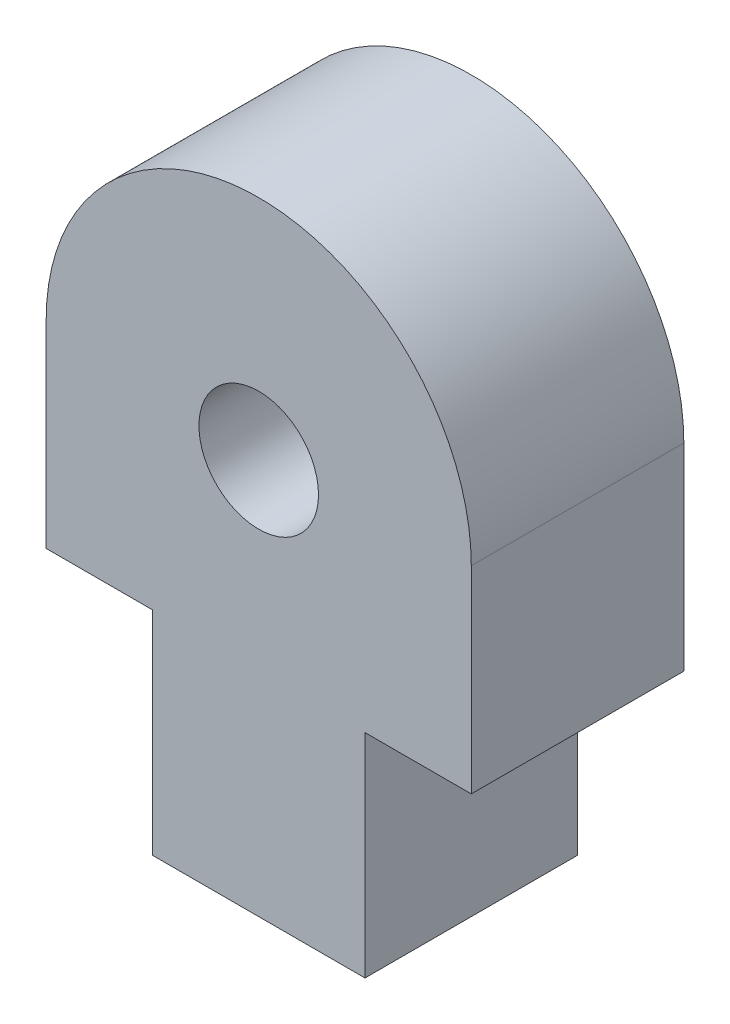
ISO-10303-21;
HEADER;
FILE_DESCRIPTION(('STEP AP214'),'2;1');
FILE_NAME('part.step','',(''),(''),'','','');
FILE_SCHEMA(('AUTOMOTIVE_DESIGN { 1 0 10303 214 1 1 1 1 }'));
ENDSEC;
DATA;
#1=APPLICATION_CONTEXT('core data for automotive mechanical design processes');
#2=APPLICATION_PROTOCOL_DEFINITION('international standard','automotive_design',2000,#1);
#3=PRODUCT_CONTEXT('',#1,'mechanical');
#4=PRODUCT('Part','Part','',(#3));
#5=PRODUCT_RELATED_PRODUCT_CATEGORY('part','',(#4));
#6=PRODUCT_DEFINITION_FORMATION('','',#4);
#7=PRODUCT_DEFINITION_CONTEXT('part definition',#1,'design');
#8=PRODUCT_DEFINITION('design','',#6,#7);
#9=PRODUCT_DEFINITION_SHAPE('','',#8);
#10=(LENGTH_UNIT() NAMED_UNIT(*) SI_UNIT(.MILLI.,.METRE.));
#11=(NAMED_UNIT(*) PLANE_ANGLE_UNIT() SI_UNIT($,.RADIAN.));
#12=(NAMED_UNIT(*) SI_UNIT($,.STERADIAN.) SOLID_ANGLE_UNIT());
#13=UNCERTAINTY_MEASURE_WITH_UNIT(LENGTH_MEASURE(1.E-05),#10,'distance_accuracy_value','');
#14=(GEOMETRIC_REPRESENTATION_CONTEXT(3) GLOBAL_UNCERTAINTY_ASSIGNED_CONTEXT((#13)) GLOBAL_UNIT_ASSIGNED_CONTEXT((#10,
#11,#12)) REPRESENTATION_CONTEXT('',''));
#15=CARTESIAN_POINT('',(0.,0.,0.));
#16=DIRECTION('',(0.,0.,1.));
#17=DIRECTION('',(1.,0.,0.));
#18=AXIS2_PLACEMENT_3D('',#15,#16,#17);
#19=CARTESIAN_POINT('',(0.,0.,6.35));
#20=DIRECTION('',(-1.,0.,0.));
#21=DIRECTION('',(0.,0.,1.));
#22=AXIS2_PLACEMENT_3D('',#19,#20,#21);
#23=PLANE('',#22);
#24=DIRECTION('',(0.,1.,0.));
#25=VECTOR('',#24,1.);
#26=CARTESIAN_POINT('',(0.,0.,0.));
#27=LINE('',#26,#25);
#28=CARTESIAN_POINT('',(0.,0.,0.));
#29=VERTEX_POINT('',#28);
#30=CARTESIAN_POINT('',(0.,6.35,0.));
#31=VERTEX_POINT('',#30);
#32=EDGE_CURVE('E128',#29,#31,#27,.T.);
#33=ORIENTED_EDGE('',*,*,#32,.T.);
#34=DIRECTION('',(0.,0.,-1.));
#35=VECTOR('',#34,1.);
#36=CARTESIAN_POINT('',(0.,6.35,6.35));
#37=LINE('',#36,#35);
#38=CARTESIAN_POINT('',(0.,6.35,6.35));
#39=VERTEX_POINT('',#38);
#40=EDGE_CURVE('E11',#39,#31,#37,.T.);
#41=ORIENTED_EDGE('',*,*,#40,.F.);
#42=DIRECTION('',(0.,1.,0.));
#43=VECTOR('',#42,1.);
#44=CARTESIAN_POINT('',(0.,0.,6.35));
#45=LINE('',#44,#43);
#46=CARTESIAN_POINT('',(0.,0.,6.35));
#47=VERTEX_POINT('',#46);
#48=EDGE_CURVE('E143',#47,#39,#45,.T.);
#49=ORIENTED_EDGE('',*,*,#48,.F.);
#50=DIRECTION('',(0.,0.,-1.));
#51=VECTOR('',#50,1.);
#52=CARTESIAN_POINT('',(0.,0.,6.35));
#53=LINE('',#52,#51);
#54=EDGE_CURVE('E124',#47,#29,#53,.T.);
#55=ORIENTED_EDGE('',*,*,#54,.T.);
#56=EDGE_LOOP('',(#33,#41,#49,#55));
#57=FACE_BOUND('',#56,.T.);
#58=ADVANCED_FACE('F32',(#57),#23,.F.);
#59=CARTESIAN_POINT('',(3.175,6.35,6.35));
#60=DIRECTION('',(0.,1.,0.));
#61=DIRECTION('',(-1.,0.,0.));
#62=AXIS2_PLACEMENT_3D('',#59,#60,#61);
#63=PLANE('',#62);
#64=DIRECTION('',(1.,0.,0.));
#65=VECTOR('',#64,1.);
#66=CARTESIAN_POINT('',(3.175,6.35,0.));
#67=LINE('',#66,#65);
#68=CARTESIAN_POINT('',(3.175,6.35,0.));
#69=VERTEX_POINT('',#68);
#70=EDGE_CURVE('E131',#31,#69,#67,.T.);
#71=ORIENTED_EDGE('',*,*,#70,.T.);
#72=DIRECTION('',(0.,0.,-1.));
#73=VECTOR('',#72,1.);
#74=CARTESIAN_POINT('',(3.175,6.35,6.35));
#75=LINE('',#74,#73);
#76=CARTESIAN_POINT('',(3.175,6.35,6.35));
#77=VERTEX_POINT('',#76);
#78=EDGE_CURVE('E40',#77,#69,#75,.T.);
#79=ORIENTED_EDGE('',*,*,#78,.F.);
#80=DIRECTION('',(1.,0.,0.));
#81=VECTOR('',#80,1.);
#82=CARTESIAN_POINT('',(3.175,6.35,6.35));
#83=LINE('',#82,#81);
#84=EDGE_CURVE('E91',#39,#77,#83,.T.);
#85=ORIENTED_EDGE('',*,*,#84,.F.);
#86=ORIENTED_EDGE('',*,*,#40,.T.);
#87=EDGE_LOOP('',(#71,#79,#85,#86));
#88=FACE_BOUND('',#87,.T.);
#89=ADVANCED_FACE('F196',(#88),#63,.F.);
#90=CARTESIAN_POINT('',(3.175,12.25423,6.35));
#91=DIRECTION('',(-1.,0.,0.));
#92=DIRECTION('',(0.,-1.,0.));
#93=AXIS2_PLACEMENT_3D('',#90,#91,#92);
#94=PLANE('',#93);
#95=DIRECTION('',(0.,1.,0.));
#96=VECTOR('',#95,1.);
#97=CARTESIAN_POINT('',(3.175,12.25423,0.));
#98=LINE('',#97,#96);
#99=CARTESIAN_POINT('',(3.175,12.25423,0.));
#100=VERTEX_POINT('',#99);
#101=EDGE_CURVE('E134',#69,#100,#98,.T.);
#102=ORIENTED_EDGE('',*,*,#101,.T.);
#103=DIRECTION('',(0.,0.,-1.));
#104=VECTOR('',#103,1.);
#105=CARTESIAN_POINT('',(3.175,12.25423,6.35));
#106=LINE('',#105,#104);
#107=CARTESIAN_POINT('',(3.175,12.25423,6.35));
#108=VERTEX_POINT('',#107);
#109=EDGE_CURVE('E150',#108,#100,#106,.T.);
#110=ORIENTED_EDGE('',*,*,#109,.F.);
#111=DIRECTION('',(0.,1.,0.));
#112=VECTOR('',#111,1.);
#113=CARTESIAN_POINT('',(3.175,12.25423,6.35));
#114=LINE('',#113,#112);
#115=EDGE_CURVE('E158',#77,#108,#114,.T.);
#116=ORIENTED_EDGE('',*,*,#115,.F.);
#117=ORIENTED_EDGE('',*,*,#78,.T.);
#118=EDGE_LOOP('',(#102,#110,#116,#117));
#119=FACE_BOUND('',#118,.T.);
#120=ADVANCED_FACE('F156',(#119),#94,.F.);
#121=CARTESIAN_POINT('',(-3.175,12.25423,6.35));
#122=DIRECTION('',(0.,0.,-1.));
#123=DIRECTION('',(-1.,0.,0.));
#124=AXIS2_PLACEMENT_3D('',#121,#122,#123);
#125=CYLINDRICAL_SURFACE('',#124,6.35);
#126=CARTESIAN_POINT('',(-3.175,12.25423,0.));
#127=DIRECTION('',(0.,0.,1.));
#128=DIRECTION('',(-1.,0.,0.));
#129=AXIS2_PLACEMENT_3D('',#126,#127,#128);
#130=CIRCLE('',#129,6.35);
#131=CARTESIAN_POINT('',(-9.525,12.25423,0.));
#132=VERTEX_POINT('',#131);
#133=EDGE_CURVE('E136',#100,#132,#130,.T.);
#134=ORIENTED_EDGE('',*,*,#133,.T.);
#135=DIRECTION('',(0.,0.,-1.));
#136=VECTOR('',#135,1.);
#137=CARTESIAN_POINT('',(-9.525,12.25423,6.35));
#138=LINE('',#137,#136);
#139=CARTESIAN_POINT('',(-9.525,12.25423,6.35));
#140=VERTEX_POINT('',#139);
#141=EDGE_CURVE('E147',#140,#132,#138,.T.);
#142=ORIENTED_EDGE('',*,*,#141,.F.);
#143=CARTESIAN_POINT('',(-3.175,12.25423,6.35));
#144=DIRECTION('',(0.,0.,1.));
#145=DIRECTION('',(-1.,0.,0.));
#146=AXIS2_PLACEMENT_3D('',#143,#144,#145);
#147=CIRCLE('',#146,6.35);
#148=EDGE_CURVE('E170',#108,#140,#147,.T.);
#149=ORIENTED_EDGE('',*,*,#148,.F.);
#150=ORIENTED_EDGE('',*,*,#109,.T.);
#151=EDGE_LOOP('',(#134,#142,#149,#150));
#152=FACE_BOUND('',#151,.T.);
#153=ADVANCED_FACE('F166',(#152),#125,.T.);
#154=CARTESIAN_POINT('',(-9.525,12.25423,6.35));
#155=DIRECTION('',(1.,0.,0.));
#156=DIRECTION('',(0.,1.,0.));
#157=AXIS2_PLACEMENT_3D('',#154,#155,#156);
#158=PLANE('',#157);
#159=DIRECTION('',(0.,-1.,0.));
#160=VECTOR('',#159,1.);
#161=CARTESIAN_POINT('',(-9.525,12.25423,0.));
#162=LINE('',#161,#160);
#163=CARTESIAN_POINT('',(-9.525,6.35,0.));
#164=VERTEX_POINT('',#163);
#165=EDGE_CURVE('E138',#132,#164,#162,.T.);
#166=ORIENTED_EDGE('',*,*,#165,.T.);
#167=DIRECTION('',(0.,0.,-1.));
#168=VECTOR('',#167,1.);
#169=CARTESIAN_POINT('',(-9.525,6.35,6.35));
#170=LINE('',#169,#168);
#171=CARTESIAN_POINT('',(-9.525,6.35,6.35));
#172=VERTEX_POINT('',#171);
#173=EDGE_CURVE('E119',#172,#164,#170,.T.);
#174=ORIENTED_EDGE('',*,*,#173,.F.);
#175=DIRECTION('',(0.,-1.,0.));
#176=VECTOR('',#175,1.);
#177=CARTESIAN_POINT('',(-9.525,12.25423,6.35));
#178=LINE('',#177,#176);
#179=EDGE_CURVE('E110',#140,#172,#178,.T.);
#180=ORIENTED_EDGE('',*,*,#179,.F.);
#181=ORIENTED_EDGE('',*,*,#141,.T.);
#182=EDGE_LOOP('',(#166,#174,#180,#181));
#183=FACE_BOUND('',#182,.T.);
#184=ADVANCED_FACE('F169',(#183),#158,.F.);
#185=CARTESIAN_POINT('',(-6.35,6.35,6.35));
#186=DIRECTION('',(0.,1.,0.));
#187=DIRECTION('',(0.,0.,1.));
#188=AXIS2_PLACEMENT_3D('',#185,#186,#187);
#189=PLANE('',#188);
#190=DIRECTION('',(1.,0.,0.));
#191=VECTOR('',#190,1.);
#192=CARTESIAN_POINT('',(-6.35,6.35,0.));
#193=LINE('',#192,#191);
#194=CARTESIAN_POINT('',(-6.35,6.35,0.));
#195=VERTEX_POINT('',#194);
#196=EDGE_CURVE('E118',#164,#195,#193,.T.);
#197=ORIENTED_EDGE('',*,*,#196,.T.);
#198=DIRECTION('',(0.,0.,-1.));
#199=VECTOR('',#198,1.);
#200=CARTESIAN_POINT('',(-6.35,6.35,6.35));
#201=LINE('',#200,#199);
#202=CARTESIAN_POINT('',(-6.35,6.35,6.35));
#203=VERTEX_POINT('',#202);
#204=EDGE_CURVE('E115',#203,#195,#201,.T.);
#205=ORIENTED_EDGE('',*,*,#204,.F.);
#206=DIRECTION('',(1.,0.,0.));
#207=VECTOR('',#206,1.);
#208=CARTESIAN_POINT('',(-6.35,6.35,6.35));
#209=LINE('',#208,#207);
#210=EDGE_CURVE('E104',#172,#203,#209,.T.);
#211=ORIENTED_EDGE('',*,*,#210,.F.);
#212=ORIENTED_EDGE('',*,*,#173,.T.);
#213=EDGE_LOOP('',(#197,#205,#211,#212));
#214=FACE_BOUND('',#213,.T.);
#215=ADVANCED_FACE('F116',(#214),#189,.F.);
#216=CARTESIAN_POINT('',(-6.35,0.,6.35));
#217=DIRECTION('',(1.,0.,0.));
#218=DIRECTION('',(0.,0.,-1.));
#219=AXIS2_PLACEMENT_3D('',#216,#217,#218);
#220=PLANE('',#219);
#221=DIRECTION('',(0.,-1.,0.));
#222=VECTOR('',#221,1.);
#223=CARTESIAN_POINT('',(-6.35,0.,0.));
#224=LINE('',#223,#222);
#225=CARTESIAN_POINT('',(-6.35,0.,0.));
#226=VERTEX_POINT('',#225);
#227=EDGE_CURVE('E77',#195,#226,#224,.T.);
#228=ORIENTED_EDGE('',*,*,#227,.T.);
#229=DIRECTION('',(0.,0.,-1.));
#230=VECTOR('',#229,1.);
#231=CARTESIAN_POINT('',(-6.35,0.,6.35));
#232=LINE('',#231,#230);
#233=CARTESIAN_POINT('',(-6.35,0.,6.35));
#234=VERTEX_POINT('',#233);
#235=EDGE_CURVE('E120',#234,#226,#232,.T.);
#236=ORIENTED_EDGE('',*,*,#235,.F.);
#237=DIRECTION('',(0.,-1.,0.));
#238=VECTOR('',#237,1.);
#239=CARTESIAN_POINT('',(-6.35,0.,6.35));
#240=LINE('',#239,#238);
#241=EDGE_CURVE('E108',#203,#234,#240,.T.);
#242=ORIENTED_EDGE('',*,*,#241,.F.);
#243=ORIENTED_EDGE('',*,*,#204,.T.);
#244=EDGE_LOOP('',(#228,#236,#242,#243));
#245=FACE_BOUND('',#244,.T.);
#246=ADVANCED_FACE('F122',(#245),#220,.F.);
#247=CARTESIAN_POINT('',(0.,0.,6.35));
#248=DIRECTION('',(0.,1.,0.));
#249=DIRECTION('',(0.,0.,1.));
#250=AXIS2_PLACEMENT_3D('',#247,#248,#249);
#251=PLANE('',#250);
#252=DIRECTION('',(1.,0.,0.));
#253=VECTOR('',#252,1.);
#254=CARTESIAN_POINT('',(0.,0.,0.));
#255=LINE('',#254,#253);
#256=EDGE_CURVE('E83',#226,#29,#255,.T.);
#257=ORIENTED_EDGE('',*,*,#256,.T.);
#258=ORIENTED_EDGE('',*,*,#54,.F.);
#259=DIRECTION('',(1.,0.,0.));
#260=VECTOR('',#259,1.);
#261=CARTESIAN_POINT('',(0.,0.,6.35));
#262=LINE('',#261,#260);
#263=EDGE_CURVE('E48',#234,#47,#262,.T.);
#264=ORIENTED_EDGE('',*,*,#263,.F.);
#265=ORIENTED_EDGE('',*,*,#235,.T.);
#266=EDGE_LOOP('',(#257,#258,#264,#265));
#267=FACE_BOUND('',#266,.T.);
#268=ADVANCED_FACE('F185',(#267),#251,.F.);
#269=CARTESIAN_POINT('',(-3.175,12.25423,6.35));
#270=DIRECTION('',(0.,0.,-1.));
#271=DIRECTION('',(-1.,0.,0.));
#272=AXIS2_PLACEMENT_3D('',#269,#270,#271);
#273=PLANE('',#272);
#274=CARTESIAN_POINT('',(-3.175,11.80846,6.35));
#275=DIRECTION('',(0.,0.,1.));
#276=DIRECTION('',(1.,0.,0.));
#277=AXIS2_PLACEMENT_3D('',#274,#275,#276);
#278=CIRCLE('',#277,1.786001);
#279=CARTESIAN_POINT('',(-1.388999,11.80846,6.35));
#280=VERTEX_POINT('',#279);
#281=EDGE_CURVE('E178',#280,#280,#278,.T.);
#282=ORIENTED_EDGE('',*,*,#281,.F.);
#283=EDGE_LOOP('',(#282));
#284=FACE_BOUND('',#283,.T.);
#285=ORIENTED_EDGE('',*,*,#48,.T.);
#286=ORIENTED_EDGE('',*,*,#84,.T.);
#287=ORIENTED_EDGE('',*,*,#115,.T.);
#288=ORIENTED_EDGE('',*,*,#148,.T.);
#289=ORIENTED_EDGE('',*,*,#179,.T.);
#290=ORIENTED_EDGE('',*,*,#210,.T.);
#291=ORIENTED_EDGE('',*,*,#241,.T.);
#292=ORIENTED_EDGE('',*,*,#263,.T.);
#293=EDGE_LOOP('',(#285,#286,#287,#288,#289,#290,#291,#292));
#294=FACE_BOUND('',#293,.T.);
#295=ADVANCED_FACE('F106',(#284,#294),#273,.F.);
#296=CARTESIAN_POINT('',(-3.175,12.25423,0.));
#297=DIRECTION('',(0.,0.,-1.));
#298=DIRECTION('',(-1.,0.,0.));
#299=AXIS2_PLACEMENT_3D('',#296,#297,#298);
#300=PLANE('',#299);
#301=CARTESIAN_POINT('',(-3.175,11.80846,0.));
#302=DIRECTION('',(0.,0.,1.));
#303=DIRECTION('',(1.,0.,0.));
#304=AXIS2_PLACEMENT_3D('',#301,#302,#303);
#305=CIRCLE('',#304,1.786001);
#306=CARTESIAN_POINT('',(-1.388999,11.80846,0.));
#307=VERTEX_POINT('',#306);
#308=EDGE_CURVE('E132',#307,#307,#305,.T.);
#309=ORIENTED_EDGE('',*,*,#308,.T.);
#310=EDGE_LOOP('',(#309));
#311=FACE_BOUND('',#310,.T.);
#312=ORIENTED_EDGE('',*,*,#32,.F.);
#313=ORIENTED_EDGE('',*,*,#256,.F.);
#314=ORIENTED_EDGE('',*,*,#227,.F.);
#315=ORIENTED_EDGE('',*,*,#196,.F.);
#316=ORIENTED_EDGE('',*,*,#165,.F.);
#317=ORIENTED_EDGE('',*,*,#133,.F.);
#318=ORIENTED_EDGE('',*,*,#101,.F.);
#319=ORIENTED_EDGE('',*,*,#70,.F.);
#320=EDGE_LOOP('',(#312,#313,#314,#315,#316,#317,#318,#319));
#321=FACE_BOUND('',#320,.T.);
#322=ADVANCED_FACE('F162',(#311,#321),#300,.T.);
#323=CARTESIAN_POINT('',(-3.175,11.80846,6.35));
#324=DIRECTION('',(0.,0.,1.));
#325=DIRECTION('',(1.,0.,0.));
#326=AXIS2_PLACEMENT_3D('',#323,#324,#325);
#327=CYLINDRICAL_SURFACE('',#326,1.786001);
#328=ORIENTED_EDGE('',*,*,#308,.F.);
#329=EDGE_LOOP('',(#328));
#330=FACE_BOUND('',#329,.T.);
#331=ORIENTED_EDGE('',*,*,#281,.T.);
#332=EDGE_LOOP('',(#331));
#333=FACE_BOUND('',#332,.T.);
#334=ADVANCED_FACE('F182',(#330,#333),#327,.F.);
#335=CLOSED_SHELL('',(#58,#89,#120,#153,#184,#215,#246,#268,#295,#322,#334));
#336=MANIFOLD_SOLID_BREP('B2',#335);
#337=ADVANCED_BREP_SHAPE_REPRESENTATION('',(#18,#336),#14);
#338=SHAPE_DEFINITION_REPRESENTATION(#9,#337);
ENDSEC;
END-ISO-10303-21;
